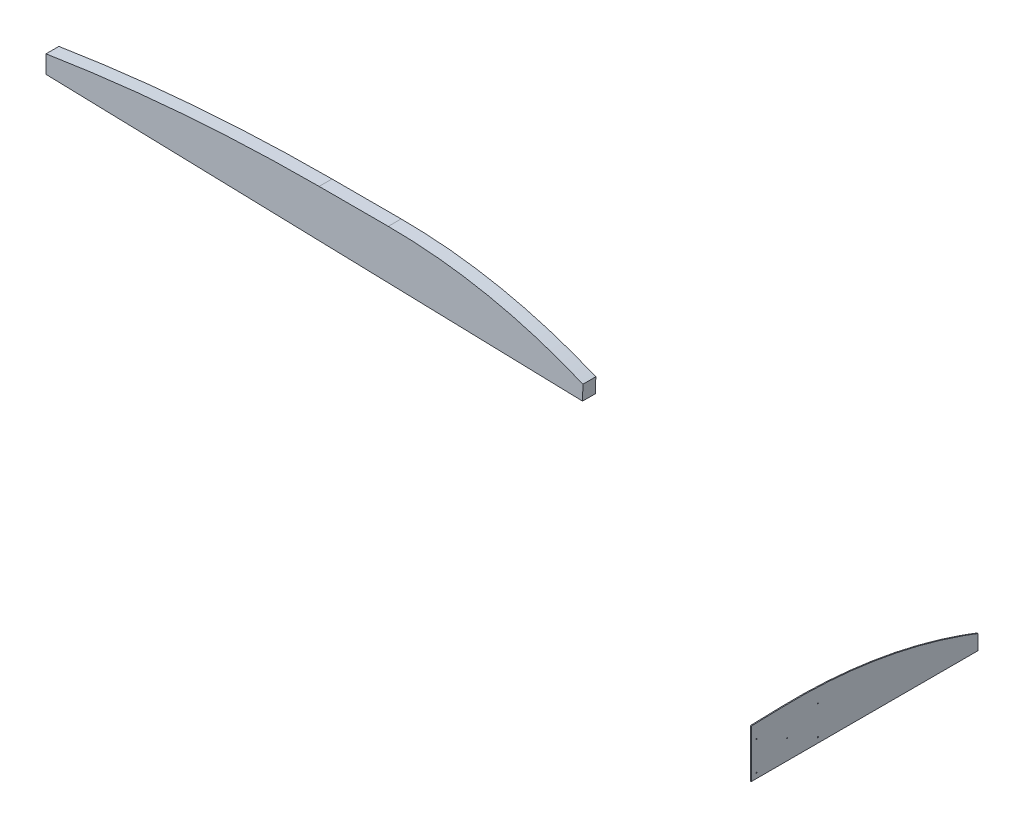
ISO-10303-21;
HEADER;
FILE_DESCRIPTION(('STEP AP214'),'2;1');
FILE_NAME('part.step','',(''),(''),'','','');
FILE_SCHEMA(('AUTOMOTIVE_DESIGN { 1 0 10303 214 1 1 1 1 }'));
ENDSEC;
DATA;
#1=APPLICATION_CONTEXT('core data for automotive mechanical design processes');
#2=APPLICATION_PROTOCOL_DEFINITION('international standard','automotive_design',2000,#1);
#3=PRODUCT_CONTEXT('',#1,'mechanical');
#4=PRODUCT('Part','Part','',(#3));
#5=PRODUCT_RELATED_PRODUCT_CATEGORY('part','',(#4));
#6=PRODUCT_DEFINITION_FORMATION('','',#4);
#7=PRODUCT_DEFINITION_CONTEXT('part definition',#1,'design');
#8=PRODUCT_DEFINITION('design','',#6,#7);
#9=PRODUCT_DEFINITION_SHAPE('','',#8);
#10=(LENGTH_UNIT() NAMED_UNIT(*) SI_UNIT(.MILLI.,.METRE.));
#11=(NAMED_UNIT(*) PLANE_ANGLE_UNIT() SI_UNIT($,.RADIAN.));
#12=(NAMED_UNIT(*) SI_UNIT($,.STERADIAN.) SOLID_ANGLE_UNIT());
#13=UNCERTAINTY_MEASURE_WITH_UNIT(LENGTH_MEASURE(1.E-05),#10,'distance_accuracy_value','');
#14=(GEOMETRIC_REPRESENTATION_CONTEXT(3) GLOBAL_UNCERTAINTY_ASSIGNED_CONTEXT((#13)) GLOBAL_UNIT_ASSIGNED_CONTEXT((#10,
#11,#12)) REPRESENTATION_CONTEXT('',''));
#15=CARTESIAN_POINT('',(0.,0.,0.));
#16=DIRECTION('',(0.,0.,1.));
#17=DIRECTION('',(1.,0.,0.));
#18=AXIS2_PLACEMENT_3D('',#15,#16,#17);
#19=CARTESIAN_POINT('',(9.398,-4451.55209296356,-441.991605716661));
#20=DIRECTION('',(1.,0.,0.));
#21=DIRECTION('',(0.,0.,-1.));
#22=AXIS2_PLACEMENT_3D('',#19,#20,#21);
#23=PLANE('',#22);
#24=CARTESIAN_POINT('',(9.398,337.933597896656,-50.799999999998));
#25=DIRECTION('',(1.,0.,0.));
#26=DIRECTION('',(0.,0.,-1.));
#27=AXIS2_PLACEMENT_3D('',#24,#25,#26);
#28=CIRCLE('',#27,4.76250000000178);
#29=CARTESIAN_POINT('',(9.398,337.933597896656,-55.5624999999997));
#30=VERTEX_POINT('',#29);
#31=EDGE_CURVE('E615',#30,#30,#28,.T.);
#32=ORIENTED_EDGE('',*,*,#31,.F.);
#33=EDGE_LOOP('',(#32));
#34=FACE_BOUND('',#33,.T.);
#35=CARTESIAN_POINT('',(9.398,50.7999999999998,-656.356957586843));
#36=DIRECTION('',(1.,0.,0.));
#37=DIRECTION('',(0.,0.,-1.));
#38=AXIS2_PLACEMENT_3D('',#35,#36,#37);
#39=CIRCLE('',#38,4.76249999999823);
#40=CARTESIAN_POINT('',(9.398,50.7999999999998,-661.119457586842));
#41=VERTEX_POINT('',#40);
#42=EDGE_CURVE('E627',#41,#41,#39,.T.);
#43=ORIENTED_EDGE('',*,*,#42,.F.);
#44=EDGE_LOOP('',(#43));
#45=FACE_BOUND('',#44,.T.);
#46=DIRECTION('',(0.,0.,1.));
#47=VECTOR('',#46,1.);
#48=CARTESIAN_POINT('',(9.398,167.187967798461,-2082.79999886147));
#49=LINE('',#48,#47);
#50=CARTESIAN_POINT('',(9.398,167.187967798461,-2083.05399886147));
#51=VERTEX_POINT('',#50);
#52=CARTESIAN_POINT('',(9.398,167.187967798461,-2082.79999886147));
#53=VERTEX_POINT('',#52);
#54=EDGE_CURVE('E264',#51,#53,#49,.T.);
#55=ORIENTED_EDGE('',*,*,#54,.T.);
#56=DIRECTION('',(0.,1.,0.));
#57=VECTOR('',#56,1.);
#58=CARTESIAN_POINT('',(9.398,203.325679208909,-2082.79999886147));
#59=LINE('',#58,#57);
#60=CARTESIAN_POINT('',(9.398,203.325679208909,-2082.79999886147));
#61=VERTEX_POINT('',#60);
#62=EDGE_CURVE('E267',#53,#61,#59,.T.);
#63=ORIENTED_EDGE('',*,*,#62,.T.);
#64=CARTESIAN_POINT('',(9.398,-4451.55209296356,-441.991605716661));
#65=DIRECTION('',(1.,0.,0.));
#66=DIRECTION('',(0.,0.,-1.));
#67=AXIS2_PLACEMENT_3D('',#64,#65,#66);
#68=CIRCLE('',#67,4935.59917911491);
#69=CARTESIAN_POINT('',(9.398,482.182478790943,-306.336040574028));
#70=VERTEX_POINT('',#69);
#71=EDGE_CURVE('E270',#61,#70,#68,.T.);
#72=ORIENTED_EDGE('',*,*,#71,.T.);
#73=DIRECTION('',(0.,-0.0274851258081607,0.999622212567983));
#74=VECTOR('',#73,1.);
#75=CARTESIAN_POINT('',(9.398,473.759742407122,-0.0047383766571818));
#76=LINE('',#75,#74);
#77=CARTESIAN_POINT('',(9.398,473.759742407122,-0.0047383766571818));
#78=VERTEX_POINT('',#77);
#79=EDGE_CURVE('E272',#70,#78,#76,.T.);
#80=ORIENTED_EDGE('',*,*,#79,.T.);
#81=DIRECTION('',(0.,-1.,0.));
#82=VECTOR('',#81,1.);
#83=CARTESIAN_POINT('',(9.398,473.759742407122,-0.0047383766571818));
#84=LINE('',#83,#82);
#85=CARTESIAN_POINT('',(9.398,-0.00167052485799957,-0.0047383766571818));
#86=VERTEX_POINT('',#85);
#87=EDGE_CURVE('E274',#78,#86,#84,.T.);
#88=ORIENTED_EDGE('',*,*,#87,.T.);
#89=DIRECTION('',(0.,0.,-1.));
#90=VECTOR('',#89,1.);
#91=CARTESIAN_POINT('',(9.398,-0.00167052485799957,-0.0047383766571818));
#92=LINE('',#91,#90);
#93=CARTESIAN_POINT('',(9.398,-0.00167052485799957,-2235.20473837666));
#94=VERTEX_POINT('',#93);
#95=EDGE_CURVE('E276',#86,#94,#92,.T.);
#96=ORIENTED_EDGE('',*,*,#95,.T.);
#97=DIRECTION('',(0.,1.,3.65014932458006E-10));
#98=VECTOR('',#97,1.);
#99=CARTESIAN_POINT('',(9.398,146.765633980461,-2235.20473832308));
#100=LINE('',#99,#98);
#101=CARTESIAN_POINT('',(9.398,146.765633980461,-2235.20473832308));
#102=VERTEX_POINT('',#101);
#103=EDGE_CURVE('E278',#94,#102,#100,.T.);
#104=ORIENTED_EDGE('',*,*,#103,.T.);
#105=CARTESIAN_POINT('',(9.398,-4451.55209296356,-441.991605716661));
#106=DIRECTION('',(1.,0.,0.));
#107=DIRECTION('',(0.,0.,-1.));
#108=AXIS2_PLACEMENT_3D('',#105,#106,#107);
#109=CIRCLE('',#108,4935.59917911491);
#110=CARTESIAN_POINT('',(9.398,203.236138383341,-2083.05399886147));
#111=VERTEX_POINT('',#110);
#112=EDGE_CURVE('E280',#102,#111,#109,.T.);
#113=ORIENTED_EDGE('',*,*,#112,.T.);
#114=DIRECTION('',(0.,-1.,0.));
#115=VECTOR('',#114,1.);
#116=CARTESIAN_POINT('',(9.398,203.236138383341,-2083.05399886147));
#117=LINE('',#116,#115);
#118=EDGE_CURVE('E282',#111,#51,#117,.T.);
#119=ORIENTED_EDGE('',*,*,#118,.T.);
#120=EDGE_LOOP('',(#55,#63,#72,#80,#88,#96,#104,#113,#119));
#121=FACE_BOUND('',#120,.T.);
#122=DIRECTION('',(0.,-1.,0.));
#123=VECTOR('',#122,1.);
#124=CARTESIAN_POINT('',(9.398,176.516033122194,-494.514909267581));
#125=LINE('',#124,#123);
#126=CARTESIAN_POINT('',(9.398,176.516033122194,-494.514909267581));
#127=VERTEX_POINT('',#126);
#128=CARTESIAN_POINT('',(9.398,176.242239609535,-494.514909267581));
#129=VERTEX_POINT('',#128);
#130=EDGE_CURVE('E178',#127,#129,#125,.T.);
#131=ORIENTED_EDGE('',*,*,#130,.T.);
#132=DIRECTION('',(0.,0.,1.));
#133=VECTOR('',#132,1.);
#134=CARTESIAN_POINT('',(9.398,176.242239609535,-494.514909267581));
#135=LINE('',#134,#133);
#136=CARTESIAN_POINT('',(9.398,176.242239609535,-486.022286640998));
#137=VERTEX_POINT('',#136);
#138=EDGE_CURVE('E187',#129,#137,#135,.T.);
#139=ORIENTED_EDGE('',*,*,#138,.T.);
#140=DIRECTION('',(0.,-1.,0.));
#141=VECTOR('',#140,1.);
#142=CARTESIAN_POINT('',(9.398,176.242239609535,-486.022286640998));
#143=LINE('',#142,#141);
#144=CARTESIAN_POINT('',(9.398,170.238877267763,-486.022286640998));
#145=VERTEX_POINT('',#144);
#146=EDGE_CURVE('E60',#137,#145,#143,.T.);
#147=ORIENTED_EDGE('',*,*,#146,.T.);
#148=DIRECTION('',(0.,0.,-1.));
#149=VECTOR('',#148,1.);
#150=CARTESIAN_POINT('',(9.398,170.238877267763,-486.022286640998));
#151=LINE('',#150,#149);
#152=CARTESIAN_POINT('',(9.398,170.238877267763,-490.197009742264));
#153=VERTEX_POINT('',#152);
#154=EDGE_CURVE('E204',#145,#153,#151,.T.);
#155=ORIENTED_EDGE('',*,*,#154,.T.);
#156=DIRECTION('',(0.,-1.,0.));
#157=VECTOR('',#156,1.);
#158=CARTESIAN_POINT('',(9.398,170.238877267763,-490.197009742264));
#159=LINE('',#158,#157);
#160=CARTESIAN_POINT('',(9.398,169.957548153839,-490.197009742264));
#161=VERTEX_POINT('',#160);
#162=EDGE_CURVE('E207',#153,#161,#159,.T.);
#163=ORIENTED_EDGE('',*,*,#162,.T.);
#164=DIRECTION('',(0.,0.,1.));
#165=VECTOR('',#164,1.);
#166=CARTESIAN_POINT('',(9.398,169.957548153839,-490.197009742264));
#167=LINE('',#166,#165);
#168=CARTESIAN_POINT('',(9.398,169.957548153839,-486.022286640998));
#169=VERTEX_POINT('',#168);
#170=EDGE_CURVE('E210',#161,#169,#167,.T.);
#171=ORIENTED_EDGE('',*,*,#170,.T.);
#172=DIRECTION('',(0.,-1.,0.));
#173=VECTOR('',#172,1.);
#174=CARTESIAN_POINT('',(9.398,169.957548153839,-486.022286640998));
#175=LINE('',#174,#173);
#176=CARTESIAN_POINT('',(9.398,163.816033122194,-486.022286640998));
#177=VERTEX_POINT('',#176);
#178=EDGE_CURVE('E213',#169,#177,#175,.T.);
#179=ORIENTED_EDGE('',*,*,#178,.T.);
#180=DIRECTION('',(0.,0.,1.));
#181=VECTOR('',#180,1.);
#182=CARTESIAN_POINT('',(9.398,163.816033122194,-486.022286640998));
#183=LINE('',#182,#181);
#184=CARTESIAN_POINT('',(9.398,163.816033122194,-485.73091005872));
#185=VERTEX_POINT('',#184);
#186=EDGE_CURVE('E216',#177,#185,#183,.T.);
#187=ORIENTED_EDGE('',*,*,#186,.T.);
#188=DIRECTION('',(0.,1.,0.));
#189=VECTOR('',#188,1.);
#190=CARTESIAN_POINT('',(9.398,163.816033122194,-485.73091005872));
#191=LINE('',#190,#189);
#192=CARTESIAN_POINT('',(9.398,176.516033122194,-485.73091005872));
#193=VERTEX_POINT('',#192);
#194=EDGE_CURVE('E219',#185,#193,#191,.T.);
#195=ORIENTED_EDGE('',*,*,#194,.T.);
#196=DIRECTION('',(0.,0.,-1.));
#197=VECTOR('',#196,1.);
#198=CARTESIAN_POINT('',(9.398,176.516033122194,-485.73091005872));
#199=LINE('',#198,#197);
#200=EDGE_CURVE('E184',#193,#127,#199,.T.);
#201=ORIENTED_EDGE('',*,*,#200,.T.);
#202=EDGE_LOOP('',(#131,#139,#147,#155,#163,#171,#179,#187,#195,#201));
#203=FACE_BOUND('',#202,.T.);
#204=CARTESIAN_POINT('',(9.398,337.933597896656,-656.356957586843));
#205=DIRECTION('',(1.,0.,0.));
#206=DIRECTION('',(0.,0.,-1.));
#207=AXIS2_PLACEMENT_3D('',#204,#205,#206);
#208=CIRCLE('',#207,4.76249999999823);
#209=CARTESIAN_POINT('',(9.398,337.933597896656,-661.119457586842));
#210=VERTEX_POINT('',#209);
#211=EDGE_CURVE('E224',#210,#210,#208,.T.);
#212=ORIENTED_EDGE('',*,*,#211,.F.);
#213=EDGE_LOOP('',(#212));
#214=FACE_BOUND('',#213,.T.);
#215=CARTESIAN_POINT('',(9.398,50.7999999999998,-50.799999999998));
#216=DIRECTION('',(1.,0.,0.));
#217=DIRECTION('',(0.,0.,-1.));
#218=AXIS2_PLACEMENT_3D('',#215,#216,#217);
#219=CIRCLE('',#218,4.76250000000178);
#220=CARTESIAN_POINT('',(9.398,50.7999999999998,-55.5624999999997));
#221=VERTEX_POINT('',#220);
#222=EDGE_CURVE('E621',#221,#221,#219,.T.);
#223=ORIENTED_EDGE('',*,*,#222,.F.);
#224=EDGE_LOOP('',(#223));
#225=FACE_BOUND('',#224,.T.);
#226=CARTESIAN_POINT('',(9.398,194.366798948328,-353.578478793422));
#227=DIRECTION('',(1.,0.,0.));
#228=DIRECTION('',(0.,0.,-1.));
#229=AXIS2_PLACEMENT_3D('',#226,#227,#228);
#230=CIRCLE('',#229,4.76249999999823);
#231=CARTESIAN_POINT('',(9.398,194.366798948328,-358.340978793421));
#232=VERTEX_POINT('',#231);
#233=EDGE_CURVE('E606',#232,#232,#230,.T.);
#234=ORIENTED_EDGE('',*,*,#233,.F.);
#235=EDGE_LOOP('',(#234));
#236=FACE_BOUND('',#235,.T.);
#237=ADVANCED_FACE('F45',(#34,#45,#121,#203,#214,#225,#236),#23,.T.);
#238=CARTESIAN_POINT('',(0.,-4451.55209296356,-441.991605716661));
#239=DIRECTION('',(1.,0.,0.));
#240=DIRECTION('',(0.,0.,-1.));
#241=AXIS2_PLACEMENT_3D('',#238,#239,#240);
#242=PLANE('',#241);
#243=DIRECTION('',(0.,0.,1.));
#244=VECTOR('',#243,1.);
#245=CARTESIAN_POINT('',(0.,176.242239609535,-494.514909267581));
#246=LINE('',#245,#244);
#247=CARTESIAN_POINT('',(0.,176.242239609535,-494.514909267581));
#248=VERTEX_POINT('',#247);
#249=CARTESIAN_POINT('',(0.,176.242239609535,-486.022286640998));
#250=VERTEX_POINT('',#249);
#251=EDGE_CURVE('E223',#248,#250,#246,.T.);
#252=ORIENTED_EDGE('',*,*,#251,.F.);
#253=DIRECTION('',(0.,-1.,0.));
#254=VECTOR('',#253,1.);
#255=CARTESIAN_POINT('',(0.,176.516033122194,-494.514909267581));
#256=LINE('',#255,#254);
#257=CARTESIAN_POINT('',(0.,176.516033122194,-494.514909267581));
#258=VERTEX_POINT('',#257);
#259=EDGE_CURVE('E68',#258,#248,#256,.T.);
#260=ORIENTED_EDGE('',*,*,#259,.F.);
#261=DIRECTION('',(0.,0.,-1.));
#262=VECTOR('',#261,1.);
#263=CARTESIAN_POINT('',(0.,176.516033122194,-485.73091005872));
#264=LINE('',#263,#262);
#265=CARTESIAN_POINT('',(0.,176.516033122194,-485.73091005872));
#266=VERTEX_POINT('',#265);
#267=EDGE_CURVE('E194',#266,#258,#264,.T.);
#268=ORIENTED_EDGE('',*,*,#267,.F.);
#269=DIRECTION('',(0.,1.,0.));
#270=VECTOR('',#269,1.);
#271=CARTESIAN_POINT('',(0.,163.816033122194,-485.73091005872));
#272=LINE('',#271,#270);
#273=CARTESIAN_POINT('',(0.,163.816033122194,-485.73091005872));
#274=VERTEX_POINT('',#273);
#275=EDGE_CURVE('E197',#274,#266,#272,.T.);
#276=ORIENTED_EDGE('',*,*,#275,.F.);
#277=DIRECTION('',(0.,0.,1.));
#278=VECTOR('',#277,1.);
#279=CARTESIAN_POINT('',(0.,163.816033122194,-486.022286640998));
#280=LINE('',#279,#278);
#281=CARTESIAN_POINT('',(0.,163.816033122194,-486.022286640998));
#282=VERTEX_POINT('',#281);
#283=EDGE_CURVE('E241',#282,#274,#280,.T.);
#284=ORIENTED_EDGE('',*,*,#283,.F.);
#285=DIRECTION('',(0.,-1.,0.));
#286=VECTOR('',#285,1.);
#287=CARTESIAN_POINT('',(0.,169.957548153839,-486.022286640998));
#288=LINE('',#287,#286);
#289=CARTESIAN_POINT('',(0.,169.957548153839,-486.022286640998));
#290=VERTEX_POINT('',#289);
#291=EDGE_CURVE('E238',#290,#282,#288,.T.);
#292=ORIENTED_EDGE('',*,*,#291,.F.);
#293=DIRECTION('',(0.,0.,1.));
#294=VECTOR('',#293,1.);
#295=CARTESIAN_POINT('',(0.,169.957548153839,-490.197009742264));
#296=LINE('',#295,#294);
#297=CARTESIAN_POINT('',(0.,169.957548153839,-490.197009742264));
#298=VERTEX_POINT('',#297);
#299=EDGE_CURVE('E235',#298,#290,#296,.T.);
#300=ORIENTED_EDGE('',*,*,#299,.F.);
#301=DIRECTION('',(0.,-1.,0.));
#302=VECTOR('',#301,1.);
#303=CARTESIAN_POINT('',(0.,170.238877267763,-490.197009742264));
#304=LINE('',#303,#302);
#305=CARTESIAN_POINT('',(0.,170.238877267763,-490.197009742264));
#306=VERTEX_POINT('',#305);
#307=EDGE_CURVE('E232',#306,#298,#304,.T.);
#308=ORIENTED_EDGE('',*,*,#307,.F.);
#309=DIRECTION('',(0.,0.,-1.));
#310=VECTOR('',#309,1.);
#311=CARTESIAN_POINT('',(0.,170.238877267763,-486.022286640998));
#312=LINE('',#311,#310);
#313=CARTESIAN_POINT('',(0.,170.238877267763,-486.022286640998));
#314=VERTEX_POINT('',#313);
#315=EDGE_CURVE('E229',#314,#306,#312,.T.);
#316=ORIENTED_EDGE('',*,*,#315,.F.);
#317=DIRECTION('',(0.,-1.,0.));
#318=VECTOR('',#317,1.);
#319=CARTESIAN_POINT('',(0.,176.242239609535,-486.022286640998));
#320=LINE('',#319,#318);
#321=EDGE_CURVE('E226',#250,#314,#320,.T.);
#322=ORIENTED_EDGE('',*,*,#321,.F.);
#323=EDGE_LOOP('',(#252,#260,#268,#276,#284,#292,#300,#308,#316,#322));
#324=FACE_BOUND('',#323,.T.);
#325=DIRECTION('',(0.,0.,1.));
#326=VECTOR('',#325,1.);
#327=CARTESIAN_POINT('',(0.,167.187967798461,-2082.79999886147));
#328=LINE('',#327,#326);
#329=CARTESIAN_POINT('',(0.,167.187967798461,-2083.05399886147));
#330=VERTEX_POINT('',#329);
#331=CARTESIAN_POINT('',(0.,167.187967798461,-2082.79999886147));
#332=VERTEX_POINT('',#331);
#333=EDGE_CURVE('E248',#330,#332,#328,.T.);
#334=ORIENTED_EDGE('',*,*,#333,.F.);
#335=DIRECTION('',(0.,-1.,0.));
#336=VECTOR('',#335,1.);
#337=CARTESIAN_POINT('',(0.,203.236138383341,-2083.05399886147));
#338=LINE('',#337,#336);
#339=CARTESIAN_POINT('',(0.,203.236138383341,-2083.05399886147));
#340=VERTEX_POINT('',#339);
#341=EDGE_CURVE('E268',#340,#330,#338,.T.);
#342=ORIENTED_EDGE('',*,*,#341,.F.);
#343=CARTESIAN_POINT('',(0.,-4451.55209296356,-441.991605716661));
#344=DIRECTION('',(1.,0.,0.));
#345=DIRECTION('',(0.,0.,-1.));
#346=AXIS2_PLACEMENT_3D('',#343,#344,#345);
#347=CIRCLE('',#346,4935.59917911491);
#348=CARTESIAN_POINT('',(0.,146.765633980461,-2235.20473832308));
#349=VERTEX_POINT('',#348);
#350=EDGE_CURVE('E299',#349,#340,#347,.T.);
#351=ORIENTED_EDGE('',*,*,#350,.F.);
#352=DIRECTION('',(0.,1.,3.65014932458006E-10));
#353=VECTOR('',#352,1.);
#354=CARTESIAN_POINT('',(0.,146.765633980461,-2235.20473832308));
#355=LINE('',#354,#353);
#356=CARTESIAN_POINT('',(0.,-0.00167052485799957,-2235.20473837666));
#357=VERTEX_POINT('',#356);
#358=EDGE_CURVE('E297',#357,#349,#355,.T.);
#359=ORIENTED_EDGE('',*,*,#358,.F.);
#360=DIRECTION('',(0.,0.,-1.));
#361=VECTOR('',#360,1.);
#362=CARTESIAN_POINT('',(0.,-0.00167052485799957,-0.0047383766571818));
#363=LINE('',#362,#361);
#364=CARTESIAN_POINT('',(0.,-0.00167052485799957,-0.0047383766571818));
#365=VERTEX_POINT('',#364);
#366=EDGE_CURVE('E295',#365,#357,#363,.T.);
#367=ORIENTED_EDGE('',*,*,#366,.F.);
#368=DIRECTION('',(0.,-1.,0.));
#369=VECTOR('',#368,1.);
#370=CARTESIAN_POINT('',(0.,473.759742407122,-0.0047383766571818));
#371=LINE('',#370,#369);
#372=CARTESIAN_POINT('',(0.,473.759742407122,-0.0047383766571818));
#373=VERTEX_POINT('',#372);
#374=EDGE_CURVE('E293',#373,#365,#371,.T.);
#375=ORIENTED_EDGE('',*,*,#374,.F.);
#376=DIRECTION('',(0.,-0.0274851258081607,0.999622212567983));
#377=VECTOR('',#376,1.);
#378=CARTESIAN_POINT('',(0.,473.759742407122,-0.0047383766571818));
#379=LINE('',#378,#377);
#380=CARTESIAN_POINT('',(0.,482.182478790943,-306.336040574028));
#381=VERTEX_POINT('',#380);
#382=EDGE_CURVE('E291',#381,#373,#379,.T.);
#383=ORIENTED_EDGE('',*,*,#382,.F.);
#384=CARTESIAN_POINT('',(0.,-4451.55209296356,-441.991605716661));
#385=DIRECTION('',(1.,0.,0.));
#386=DIRECTION('',(0.,0.,-1.));
#387=AXIS2_PLACEMENT_3D('',#384,#385,#386);
#388=CIRCLE('',#387,4935.59917911491);
#389=CARTESIAN_POINT('',(0.,203.325679208909,-2082.79999886147));
#390=VERTEX_POINT('',#389);
#391=EDGE_CURVE('E289',#390,#381,#388,.T.);
#392=ORIENTED_EDGE('',*,*,#391,.F.);
#393=DIRECTION('',(0.,1.,0.));
#394=VECTOR('',#393,1.);
#395=CARTESIAN_POINT('',(0.,203.325679208909,-2082.79999886147));
#396=LINE('',#395,#394);
#397=EDGE_CURVE('E287',#332,#390,#396,.T.);
#398=ORIENTED_EDGE('',*,*,#397,.F.);
#399=EDGE_LOOP('',(#334,#342,#351,#359,#367,#375,#383,#392,#398));
#400=FACE_BOUND('',#399,.T.);
#401=CARTESIAN_POINT('',(0.,337.933597896656,-656.356957586843));
#402=DIRECTION('',(1.,0.,0.));
#403=DIRECTION('',(0.,0.,-1.));
#404=AXIS2_PLACEMENT_3D('',#401,#402,#403);
#405=CIRCLE('',#404,4.76249999999823);
#406=CARTESIAN_POINT('',(0.,337.933597896656,-661.119457586842));
#407=VERTEX_POINT('',#406);
#408=EDGE_CURVE('E200',#407,#407,#405,.T.);
#409=ORIENTED_EDGE('',*,*,#408,.T.);
#410=EDGE_LOOP('',(#409));
#411=FACE_BOUND('',#410,.T.);
#412=CARTESIAN_POINT('',(0.,50.7999999999998,-656.356957586843));
#413=DIRECTION('',(1.,0.,0.));
#414=DIRECTION('',(0.,0.,-1.));
#415=AXIS2_PLACEMENT_3D('',#412,#413,#414);
#416=CIRCLE('',#415,4.76249999999823);
#417=CARTESIAN_POINT('',(0.,50.7999999999998,-661.119457586842));
#418=VERTEX_POINT('',#417);
#419=EDGE_CURVE('E624',#418,#418,#416,.T.);
#420=ORIENTED_EDGE('',*,*,#419,.T.);
#421=EDGE_LOOP('',(#420));
#422=FACE_BOUND('',#421,.T.);
#423=CARTESIAN_POINT('',(0.,50.7999999999998,-50.799999999998));
#424=DIRECTION('',(1.,0.,0.));
#425=DIRECTION('',(0.,0.,-1.));
#426=AXIS2_PLACEMENT_3D('',#423,#424,#425);
#427=CIRCLE('',#426,4.76250000000178);
#428=CARTESIAN_POINT('',(0.,50.7999999999998,-55.5624999999997));
#429=VERTEX_POINT('',#428);
#430=EDGE_CURVE('E618',#429,#429,#427,.T.);
#431=ORIENTED_EDGE('',*,*,#430,.T.);
#432=EDGE_LOOP('',(#431));
#433=FACE_BOUND('',#432,.T.);
#434=CARTESIAN_POINT('',(0.,337.933597896656,-50.799999999998));
#435=DIRECTION('',(1.,0.,0.));
#436=DIRECTION('',(0.,0.,-1.));
#437=AXIS2_PLACEMENT_3D('',#434,#435,#436);
#438=CIRCLE('',#437,4.76250000000178);
#439=CARTESIAN_POINT('',(0.,337.933597896656,-55.5624999999997));
#440=VERTEX_POINT('',#439);
#441=EDGE_CURVE('E612',#440,#440,#438,.T.);
#442=ORIENTED_EDGE('',*,*,#441,.T.);
#443=EDGE_LOOP('',(#442));
#444=FACE_BOUND('',#443,.T.);
#445=CARTESIAN_POINT('',(0.,194.366798948328,-353.578478793422));
#446=DIRECTION('',(1.,0.,0.));
#447=DIRECTION('',(0.,0.,-1.));
#448=AXIS2_PLACEMENT_3D('',#445,#446,#447);
#449=CIRCLE('',#448,4.76249999999823);
#450=CARTESIAN_POINT('',(0.,194.366798948328,-358.340978793421));
#451=VERTEX_POINT('',#450);
#452=EDGE_CURVE('E609',#451,#451,#449,.T.);
#453=ORIENTED_EDGE('',*,*,#452,.T.);
#454=EDGE_LOOP('',(#453));
#455=FACE_BOUND('',#454,.T.);
#456=ADVANCED_FACE('F332',(#324,#400,#411,#422,#433,#444,#455),#242,.F.);
#457=CARTESIAN_POINT('',(9.398,167.187967798461,-2082.79999886147));
#458=DIRECTION('',(0.,-1.,0.));
#459=DIRECTION('',(0.,0.,-1.));
#460=AXIS2_PLACEMENT_3D('',#457,#458,#459);
#461=PLANE('',#460);
#462=ORIENTED_EDGE('',*,*,#333,.T.);
#463=DIRECTION('',(-1.,0.,0.));
#464=VECTOR('',#463,1.);
#465=CARTESIAN_POINT('',(9.398,167.187967798461,-2082.79999886147));
#466=LINE('',#465,#464);
#467=EDGE_CURVE('E12',#53,#332,#466,.T.);
#468=ORIENTED_EDGE('',*,*,#467,.F.);
#469=ORIENTED_EDGE('',*,*,#54,.F.);
#470=DIRECTION('',(-1.,0.,0.));
#471=VECTOR('',#470,1.);
#472=CARTESIAN_POINT('',(9.398,167.187967798461,-2083.05399886147));
#473=LINE('',#472,#471);
#474=EDGE_CURVE('E284',#51,#330,#473,.T.);
#475=ORIENTED_EDGE('',*,*,#474,.T.);
#476=EDGE_LOOP('',(#462,#468,#469,#475));
#477=FACE_BOUND('',#476,.T.);
#478=ADVANCED_FACE('F47',(#477),#461,.F.);
#479=CARTESIAN_POINT('',(9.398,203.325679208909,-2082.79999886147));
#480=DIRECTION('',(0.,0.,1.));
#481=DIRECTION('',(1.,0.,0.));
#482=AXIS2_PLACEMENT_3D('',#479,#480,#481);
#483=PLANE('',#482);
#484=ORIENTED_EDGE('',*,*,#397,.T.);
#485=DIRECTION('',(-1.,0.,0.));
#486=VECTOR('',#485,1.);
#487=CARTESIAN_POINT('',(9.398,203.325679208909,-2082.79999886147));
#488=LINE('',#487,#486);
#489=EDGE_CURVE('E53',#61,#390,#488,.T.);
#490=ORIENTED_EDGE('',*,*,#489,.F.);
#491=ORIENTED_EDGE('',*,*,#62,.F.);
#492=ORIENTED_EDGE('',*,*,#467,.T.);
#493=EDGE_LOOP('',(#484,#490,#491,#492));
#494=FACE_BOUND('',#493,.T.);
#495=ADVANCED_FACE('F349',(#494),#483,.F.);
#496=CARTESIAN_POINT('',(9.398,-4451.55209296356,-441.991605716661));
#497=DIRECTION('',(-1.,0.,0.));
#498=DIRECTION('',(0.,0.,1.));
#499=AXIS2_PLACEMENT_3D('',#496,#497,#498);
#500=CYLINDRICAL_SURFACE('',#499,4935.59917911491);
#501=ORIENTED_EDGE('',*,*,#391,.T.);
#502=DIRECTION('',(-1.,0.,0.));
#503=VECTOR('',#502,1.);
#504=CARTESIAN_POINT('',(9.398,482.182478790943,-306.336040574028));
#505=LINE('',#504,#503);
#506=EDGE_CURVE('E319',#70,#381,#505,.T.);
#507=ORIENTED_EDGE('',*,*,#506,.F.);
#508=ORIENTED_EDGE('',*,*,#71,.F.);
#509=ORIENTED_EDGE('',*,*,#489,.T.);
#510=EDGE_LOOP('',(#501,#507,#508,#509));
#511=FACE_BOUND('',#510,.T.);
#512=ADVANCED_FACE('F326',(#511),#500,.T.);
#513=CARTESIAN_POINT('',(9.398,473.759742407122,-0.0047383766571818));
#514=DIRECTION('',(0.,-0.999622212567983,-0.0274851258081607));
#515=DIRECTION('',(0.,0.0274851258081607,-0.999622212567983));
#516=AXIS2_PLACEMENT_3D('',#513,#514,#515);
#517=PLANE('',#516);
#518=ORIENTED_EDGE('',*,*,#382,.T.);
#519=DIRECTION('',(-1.,0.,0.));
#520=VECTOR('',#519,1.);
#521=CARTESIAN_POINT('',(9.398,473.759742407122,-0.0047383766571818));
#522=LINE('',#521,#520);
#523=EDGE_CURVE('E316',#78,#373,#522,.T.);
#524=ORIENTED_EDGE('',*,*,#523,.F.);
#525=ORIENTED_EDGE('',*,*,#79,.F.);
#526=ORIENTED_EDGE('',*,*,#506,.T.);
#527=EDGE_LOOP('',(#518,#524,#525,#526));
#528=FACE_BOUND('',#527,.T.);
#529=ADVANCED_FACE('F338',(#528),#517,.F.);
#530=CARTESIAN_POINT('',(9.398,473.759742407122,-0.0047383766571818));
#531=DIRECTION('',(0.,0.,-1.));
#532=DIRECTION('',(-1.,0.,0.));
#533=AXIS2_PLACEMENT_3D('',#530,#531,#532);
#534=PLANE('',#533);
#535=ORIENTED_EDGE('',*,*,#374,.T.);
#536=DIRECTION('',(-1.,0.,0.));
#537=VECTOR('',#536,1.);
#538=CARTESIAN_POINT('',(9.398,-0.00167052485799957,-0.0047383766571818));
#539=LINE('',#538,#537);
#540=EDGE_CURVE('E313',#86,#365,#539,.T.);
#541=ORIENTED_EDGE('',*,*,#540,.F.);
#542=ORIENTED_EDGE('',*,*,#87,.F.);
#543=ORIENTED_EDGE('',*,*,#523,.T.);
#544=EDGE_LOOP('',(#535,#541,#542,#543));
#545=FACE_BOUND('',#544,.T.);
#546=ADVANCED_FACE('F342',(#545),#534,.F.);
#547=CARTESIAN_POINT('',(9.398,-0.00167052485799957,-0.0047383766571818));
#548=DIRECTION('',(0.,1.,0.));
#549=DIRECTION('',(0.,0.,1.));
#550=AXIS2_PLACEMENT_3D('',#547,#548,#549);
#551=PLANE('',#550);
#552=ORIENTED_EDGE('',*,*,#366,.T.);
#553=DIRECTION('',(-1.,0.,0.));
#554=VECTOR('',#553,1.);
#555=CARTESIAN_POINT('',(9.398,-0.00167052485799957,-2235.20473837666));
#556=LINE('',#555,#554);
#557=EDGE_CURVE('E310',#94,#357,#556,.T.);
#558=ORIENTED_EDGE('',*,*,#557,.F.);
#559=ORIENTED_EDGE('',*,*,#95,.F.);
#560=ORIENTED_EDGE('',*,*,#540,.T.);
#561=EDGE_LOOP('',(#552,#558,#559,#560));
#562=FACE_BOUND('',#561,.T.);
#563=ADVANCED_FACE('F367',(#562),#551,.F.);
#564=CARTESIAN_POINT('',(9.398,146.765633980461,-2235.20473832308));
#565=DIRECTION('',(0.,-3.65014932458006E-10,1.));
#566=DIRECTION('',(0.,-1.,-3.65014932458006E-10));
#567=AXIS2_PLACEMENT_3D('',#564,#565,#566);
#568=PLANE('',#567);
#569=ORIENTED_EDGE('',*,*,#358,.T.);
#570=DIRECTION('',(-1.,0.,0.));
#571=VECTOR('',#570,1.);
#572=CARTESIAN_POINT('',(9.398,146.765633980461,-2235.20473832308));
#573=LINE('',#572,#571);
#574=EDGE_CURVE('E307',#102,#349,#573,.T.);
#575=ORIENTED_EDGE('',*,*,#574,.F.);
#576=ORIENTED_EDGE('',*,*,#103,.F.);
#577=ORIENTED_EDGE('',*,*,#557,.T.);
#578=EDGE_LOOP('',(#569,#575,#576,#577));
#579=FACE_BOUND('',#578,.T.);
#580=ADVANCED_FACE('F365',(#579),#568,.F.);
#581=CARTESIAN_POINT('',(9.398,-4451.55209296356,-441.991605716661));
#582=DIRECTION('',(-1.,0.,0.));
#583=DIRECTION('',(0.,0.,1.));
#584=AXIS2_PLACEMENT_3D('',#581,#582,#583);
#585=CYLINDRICAL_SURFACE('',#584,4935.59917911491);
#586=ORIENTED_EDGE('',*,*,#350,.T.);
#587=DIRECTION('',(-1.,0.,0.));
#588=VECTOR('',#587,1.);
#589=CARTESIAN_POINT('',(9.398,203.236138383341,-2083.05399886147));
#590=LINE('',#589,#588);
#591=EDGE_CURVE('E304',#111,#340,#590,.T.);
#592=ORIENTED_EDGE('',*,*,#591,.F.);
#593=ORIENTED_EDGE('',*,*,#112,.F.);
#594=ORIENTED_EDGE('',*,*,#574,.T.);
#595=EDGE_LOOP('',(#586,#592,#593,#594));
#596=FACE_BOUND('',#595,.T.);
#597=ADVANCED_FACE('F361',(#596),#585,.T.);
#598=CARTESIAN_POINT('',(9.398,203.236138383341,-2083.05399886147));
#599=DIRECTION('',(0.,0.,-1.));
#600=DIRECTION('',(-1.,0.,0.));
#601=AXIS2_PLACEMENT_3D('',#598,#599,#600);
#602=PLANE('',#601);
#603=ORIENTED_EDGE('',*,*,#341,.T.);
#604=ORIENTED_EDGE('',*,*,#474,.F.);
#605=ORIENTED_EDGE('',*,*,#118,.F.);
#606=ORIENTED_EDGE('',*,*,#591,.T.);
#607=EDGE_LOOP('',(#603,#604,#605,#606));
#608=FACE_BOUND('',#607,.T.);
#609=ADVANCED_FACE('F356',(#608),#602,.F.);
#610=CARTESIAN_POINT('',(9.398,176.516033122194,-494.514909267581));
#611=DIRECTION('',(0.,0.,-1.));
#612=DIRECTION('',(-1.,0.,0.));
#613=AXIS2_PLACEMENT_3D('',#610,#611,#612);
#614=PLANE('',#613);
#615=ORIENTED_EDGE('',*,*,#259,.T.);
#616=DIRECTION('',(-1.,0.,0.));
#617=VECTOR('',#616,1.);
#618=CARTESIAN_POINT('',(9.398,176.242239609535,-494.514909267581));
#619=LINE('',#618,#617);
#620=EDGE_CURVE('E174',#129,#248,#619,.T.);
#621=ORIENTED_EDGE('',*,*,#620,.F.);
#622=ORIENTED_EDGE('',*,*,#130,.F.);
#623=DIRECTION('',(-1.,0.,0.));
#624=VECTOR('',#623,1.);
#625=CARTESIAN_POINT('',(9.398,176.516033122194,-494.514909267581));
#626=LINE('',#625,#624);
#627=EDGE_CURVE('E246',#127,#258,#626,.T.);
#628=ORIENTED_EDGE('',*,*,#627,.T.);
#629=EDGE_LOOP('',(#615,#621,#622,#628));
#630=FACE_BOUND('',#629,.T.);
#631=ADVANCED_FACE('F176',(#630),#614,.F.);
#632=CARTESIAN_POINT('',(9.398,176.516033122194,-485.73091005872));
#633=DIRECTION('',(0.,1.,0.));
#634=DIRECTION('',(0.,0.,1.));
#635=AXIS2_PLACEMENT_3D('',#632,#633,#634);
#636=PLANE('',#635);
#637=ORIENTED_EDGE('',*,*,#267,.T.);
#638=ORIENTED_EDGE('',*,*,#627,.F.);
#639=ORIENTED_EDGE('',*,*,#200,.F.);
#640=DIRECTION('',(-1.,0.,0.));
#641=VECTOR('',#640,1.);
#642=CARTESIAN_POINT('',(9.398,176.516033122194,-485.73091005872));
#643=LINE('',#642,#641);
#644=EDGE_CURVE('E249',#193,#266,#643,.T.);
#645=ORIENTED_EDGE('',*,*,#644,.T.);
#646=EDGE_LOOP('',(#637,#638,#639,#645));
#647=FACE_BOUND('',#646,.T.);
#648=ADVANCED_FACE('F406',(#647),#636,.F.);
#649=CARTESIAN_POINT('',(9.398,163.816033122194,-485.73091005872));
#650=DIRECTION('',(0.,0.,1.));
#651=DIRECTION('',(1.,0.,0.));
#652=AXIS2_PLACEMENT_3D('',#649,#650,#651);
#653=PLANE('',#652);
#654=ORIENTED_EDGE('',*,*,#275,.T.);
#655=ORIENTED_EDGE('',*,*,#644,.F.);
#656=ORIENTED_EDGE('',*,*,#194,.F.);
#657=DIRECTION('',(-1.,0.,0.));
#658=VECTOR('',#657,1.);
#659=CARTESIAN_POINT('',(9.398,163.816033122194,-485.73091005872));
#660=LINE('',#659,#658);
#661=EDGE_CURVE('E251',#185,#274,#660,.T.);
#662=ORIENTED_EDGE('',*,*,#661,.T.);
#663=EDGE_LOOP('',(#654,#655,#656,#662));
#664=FACE_BOUND('',#663,.T.);
#665=ADVANCED_FACE('F412',(#664),#653,.F.);
#666=CARTESIAN_POINT('',(9.398,163.816033122194,-486.022286640998));
#667=DIRECTION('',(0.,-1.,0.));
#668=DIRECTION('',(0.,0.,-1.));
#669=AXIS2_PLACEMENT_3D('',#666,#667,#668);
#670=PLANE('',#669);
#671=ORIENTED_EDGE('',*,*,#283,.T.);
#672=ORIENTED_EDGE('',*,*,#661,.F.);
#673=ORIENTED_EDGE('',*,*,#186,.F.);
#674=DIRECTION('',(-1.,0.,0.));
#675=VECTOR('',#674,1.);
#676=CARTESIAN_POINT('',(9.398,163.816033122194,-486.022286640998));
#677=LINE('',#676,#675);
#678=EDGE_CURVE('E253',#177,#282,#677,.T.);
#679=ORIENTED_EDGE('',*,*,#678,.T.);
#680=EDGE_LOOP('',(#671,#672,#673,#679));
#681=FACE_BOUND('',#680,.T.);
#682=ADVANCED_FACE('F420',(#681),#670,.F.);
#683=CARTESIAN_POINT('',(9.398,169.957548153839,-486.022286640998));
#684=DIRECTION('',(0.,0.,-1.));
#685=DIRECTION('',(-1.,0.,0.));
#686=AXIS2_PLACEMENT_3D('',#683,#684,#685);
#687=PLANE('',#686);
#688=ORIENTED_EDGE('',*,*,#291,.T.);
#689=ORIENTED_EDGE('',*,*,#678,.F.);
#690=ORIENTED_EDGE('',*,*,#178,.F.);
#691=DIRECTION('',(-1.,0.,0.));
#692=VECTOR('',#691,1.);
#693=CARTESIAN_POINT('',(9.398,169.957548153839,-486.022286640998));
#694=LINE('',#693,#692);
#695=EDGE_CURVE('E255',#169,#290,#694,.T.);
#696=ORIENTED_EDGE('',*,*,#695,.T.);
#697=EDGE_LOOP('',(#688,#689,#690,#696));
#698=FACE_BOUND('',#697,.T.);
#699=ADVANCED_FACE('F428',(#698),#687,.F.);
#700=CARTESIAN_POINT('',(9.398,169.957548153839,-490.197009742264));
#701=DIRECTION('',(0.,-1.,0.));
#702=DIRECTION('',(0.,0.,-1.));
#703=AXIS2_PLACEMENT_3D('',#700,#701,#702);
#704=PLANE('',#703);
#705=ORIENTED_EDGE('',*,*,#299,.T.);
#706=ORIENTED_EDGE('',*,*,#695,.F.);
#707=ORIENTED_EDGE('',*,*,#170,.F.);
#708=DIRECTION('',(-1.,0.,0.));
#709=VECTOR('',#708,1.);
#710=CARTESIAN_POINT('',(9.398,169.957548153839,-490.197009742264));
#711=LINE('',#710,#709);
#712=EDGE_CURVE('E257',#161,#298,#711,.T.);
#713=ORIENTED_EDGE('',*,*,#712,.T.);
#714=EDGE_LOOP('',(#705,#706,#707,#713));
#715=FACE_BOUND('',#714,.T.);
#716=ADVANCED_FACE('F436',(#715),#704,.F.);
#717=CARTESIAN_POINT('',(9.398,170.238877267763,-490.197009742264));
#718=DIRECTION('',(0.,0.,-1.));
#719=DIRECTION('',(-1.,0.,0.));
#720=AXIS2_PLACEMENT_3D('',#717,#718,#719);
#721=PLANE('',#720);
#722=ORIENTED_EDGE('',*,*,#307,.T.);
#723=ORIENTED_EDGE('',*,*,#712,.F.);
#724=ORIENTED_EDGE('',*,*,#162,.F.);
#725=DIRECTION('',(-1.,0.,0.));
#726=VECTOR('',#725,1.);
#727=CARTESIAN_POINT('',(9.398,170.238877267763,-490.197009742264));
#728=LINE('',#727,#726);
#729=EDGE_CURVE('E259',#153,#306,#728,.T.);
#730=ORIENTED_EDGE('',*,*,#729,.T.);
#731=EDGE_LOOP('',(#722,#723,#724,#730));
#732=FACE_BOUND('',#731,.T.);
#733=ADVANCED_FACE('F444',(#732),#721,.F.);
#734=CARTESIAN_POINT('',(9.398,170.238877267763,-486.022286640998));
#735=DIRECTION('',(0.,1.,0.));
#736=DIRECTION('',(0.,0.,1.));
#737=AXIS2_PLACEMENT_3D('',#734,#735,#736);
#738=PLANE('',#737);
#739=ORIENTED_EDGE('',*,*,#315,.T.);
#740=ORIENTED_EDGE('',*,*,#729,.F.);
#741=ORIENTED_EDGE('',*,*,#154,.F.);
#742=DIRECTION('',(-1.,0.,0.));
#743=VECTOR('',#742,1.);
#744=CARTESIAN_POINT('',(9.398,170.238877267763,-486.022286640998));
#745=LINE('',#744,#743);
#746=EDGE_CURVE('E261',#145,#314,#745,.T.);
#747=ORIENTED_EDGE('',*,*,#746,.T.);
#748=EDGE_LOOP('',(#739,#740,#741,#747));
#749=FACE_BOUND('',#748,.T.);
#750=ADVANCED_FACE('F452',(#749),#738,.F.);
#751=CARTESIAN_POINT('',(9.398,176.242239609535,-486.022286640998));
#752=DIRECTION('',(0.,0.,-1.));
#753=DIRECTION('',(-1.,0.,0.));
#754=AXIS2_PLACEMENT_3D('',#751,#752,#753);
#755=PLANE('',#754);
#756=ORIENTED_EDGE('',*,*,#321,.T.);
#757=ORIENTED_EDGE('',*,*,#746,.F.);
#758=ORIENTED_EDGE('',*,*,#146,.F.);
#759=DIRECTION('',(-1.,0.,0.));
#760=VECTOR('',#759,1.);
#761=CARTESIAN_POINT('',(9.398,176.242239609535,-486.022286640998));
#762=LINE('',#761,#760);
#763=EDGE_CURVE('E183',#137,#250,#762,.T.);
#764=ORIENTED_EDGE('',*,*,#763,.T.);
#765=EDGE_LOOP('',(#756,#757,#758,#764));
#766=FACE_BOUND('',#765,.T.);
#767=ADVANCED_FACE('F460',(#766),#755,.F.);
#768=CARTESIAN_POINT('',(9.398,176.242239609535,-494.514909267581));
#769=DIRECTION('',(0.,-1.,0.));
#770=DIRECTION('',(0.,0.,-1.));
#771=AXIS2_PLACEMENT_3D('',#768,#769,#770);
#772=PLANE('',#771);
#773=ORIENTED_EDGE('',*,*,#251,.T.);
#774=ORIENTED_EDGE('',*,*,#763,.F.);
#775=ORIENTED_EDGE('',*,*,#138,.F.);
#776=ORIENTED_EDGE('',*,*,#620,.T.);
#777=EDGE_LOOP('',(#773,#774,#775,#776));
#778=FACE_BOUND('',#777,.T.);
#779=ADVANCED_FACE('F188',(#778),#772,.F.);
#780=CARTESIAN_POINT('',(9.398,337.933597896656,-656.356957586843));
#781=DIRECTION('',(-1.,0.,0.));
#782=DIRECTION('',(0.,0.,1.));
#783=AXIS2_PLACEMENT_3D('',#780,#781,#782);
#784=CYLINDRICAL_SURFACE('',#783,4.76249999999823);
#785=ORIENTED_EDGE('',*,*,#211,.T.);
#786=EDGE_LOOP('',(#785));
#787=FACE_BOUND('',#786,.T.);
#788=ORIENTED_EDGE('',*,*,#408,.F.);
#789=EDGE_LOOP('',(#788));
#790=FACE_BOUND('',#789,.T.);
#791=ADVANCED_FACE('F474',(#787,#790),#784,.F.);
#792=CARTESIAN_POINT('',(9.398,50.7999999999998,-656.356957586843));
#793=DIRECTION('',(-1.,0.,0.));
#794=DIRECTION('',(0.,0.,1.));
#795=AXIS2_PLACEMENT_3D('',#792,#793,#794);
#796=CYLINDRICAL_SURFACE('',#795,4.76249999999823);
#797=ORIENTED_EDGE('',*,*,#42,.T.);
#798=EDGE_LOOP('',(#797));
#799=FACE_BOUND('',#798,.T.);
#800=ORIENTED_EDGE('',*,*,#419,.F.);
#801=EDGE_LOOP('',(#800));
#802=FACE_BOUND('',#801,.T.);
#803=ADVANCED_FACE('F480',(#799,#802),#796,.F.);
#804=CARTESIAN_POINT('',(9.398,50.7999999999998,-50.799999999998));
#805=DIRECTION('',(-1.,0.,0.));
#806=DIRECTION('',(0.,0.,1.));
#807=AXIS2_PLACEMENT_3D('',#804,#805,#806);
#808=CYLINDRICAL_SURFACE('',#807,4.76250000000178);
#809=ORIENTED_EDGE('',*,*,#222,.T.);
#810=EDGE_LOOP('',(#809));
#811=FACE_BOUND('',#810,.T.);
#812=ORIENTED_EDGE('',*,*,#430,.F.);
#813=EDGE_LOOP('',(#812));
#814=FACE_BOUND('',#813,.T.);
#815=ADVANCED_FACE('F488',(#811,#814),#808,.F.);
#816=CARTESIAN_POINT('',(9.398,337.933597896656,-50.799999999998));
#817=DIRECTION('',(-1.,0.,0.));
#818=DIRECTION('',(0.,0.,1.));
#819=AXIS2_PLACEMENT_3D('',#816,#817,#818);
#820=CYLINDRICAL_SURFACE('',#819,4.76250000000178);
#821=ORIENTED_EDGE('',*,*,#31,.T.);
#822=EDGE_LOOP('',(#821));
#823=FACE_BOUND('',#822,.T.);
#824=ORIENTED_EDGE('',*,*,#441,.F.);
#825=EDGE_LOOP('',(#824));
#826=FACE_BOUND('',#825,.T.);
#827=ADVANCED_FACE('F496',(#823,#826),#820,.F.);
#828=CARTESIAN_POINT('',(9.398,194.366798948328,-353.578478793422));
#829=DIRECTION('',(-1.,0.,0.));
#830=DIRECTION('',(0.,0.,1.));
#831=AXIS2_PLACEMENT_3D('',#828,#829,#830);
#832=CYLINDRICAL_SURFACE('',#831,4.76249999999823);
#833=ORIENTED_EDGE('',*,*,#233,.T.);
#834=EDGE_LOOP('',(#833));
#835=FACE_BOUND('',#834,.T.);
#836=ORIENTED_EDGE('',*,*,#452,.F.);
#837=EDGE_LOOP('',(#836));
#838=FACE_BOUND('',#837,.T.);
#839=ADVANCED_FACE('F504',(#835,#838),#832,.F.);
#840=CLOSED_SHELL('',(#237,#456,#478,#495,#512,#529,#546,#563,#580,#597,#609,#631,#648,#665,
#682,#699,#716,#733,#750,#767,#779,#791,#803,#815,#827,#839));
#841=MANIFOLD_SOLID_BREP('B2',#840);
#842=CARTESIAN_POINT('',(-4.00917848204745E-12,3078.50276938672,127.));
#843=DIRECTION('',(0.,1.,0.));
#844=DIRECTION('',(-1.,0.,0.));
#845=AXIS2_PLACEMENT_3D('',#842,#843,#844);
#846=PLANE('',#845);
#847=DIRECTION('',(1.,0.,0.));
#848=VECTOR('',#847,1.);
#849=CARTESIAN_POINT('',(-4.00917848204745E-12,3078.50276938672,0.));
#850=LINE('',#849,#848);
#851=CARTESIAN_POINT('',(-4124.10138473646,3078.50276938672,0.));
#852=VERTEX_POINT('',#851);
#853=CARTESIAN_POINT('',(-3442.10138473647,3078.50276938672,0.));
#854=VERTEX_POINT('',#853);
#855=EDGE_CURVE('E748',#852,#854,#850,.T.);
#856=ORIENTED_EDGE('',*,*,#855,.F.);
#857=DIRECTION('',(0.,0.,-1.));
#858=VECTOR('',#857,1.);
#859=CARTESIAN_POINT('',(-4124.10138473646,3078.50276938672,127.));
#860=LINE('',#859,#858);
#861=CARTESIAN_POINT('',(-4124.10138473646,3078.50276938672,127.));
#862=VERTEX_POINT('',#861);
#863=EDGE_CURVE('E43',#862,#852,#860,.T.);
#864=ORIENTED_EDGE('',*,*,#863,.F.);
#865=DIRECTION('',(1.,0.,0.));
#866=VECTOR('',#865,1.);
#867=CARTESIAN_POINT('',(-4.00917848204745E-12,3078.50276938672,127.));
#868=LINE('',#867,#866);
#869=CARTESIAN_POINT('',(-3442.10138473647,3078.50276938672,127.));
#870=VERTEX_POINT('',#869);
#871=EDGE_CURVE('E760',#862,#870,#868,.T.);
#872=ORIENTED_EDGE('',*,*,#871,.T.);
#873=DIRECTION('',(0.,0.,-1.));
#874=VECTOR('',#873,1.);
#875=CARTESIAN_POINT('',(-3442.10138473647,3078.50276938672,127.));
#876=LINE('',#875,#874);
#877=EDGE_CURVE('E710',#870,#854,#876,.T.);
#878=ORIENTED_EDGE('',*,*,#877,.T.);
#879=EDGE_LOOP('',(#856,#864,#872,#878));
#880=FACE_BOUND('',#879,.T.);
#881=ADVANCED_FACE('F666',(#880),#846,.T.);
#882=CARTESIAN_POINT('',(-4124.10138473647,-13950.1652306133,127.));
#883=DIRECTION('',(0.,0.,-1.));
#884=DIRECTION('',(-1.,0.,0.));
#885=AXIS2_PLACEMENT_3D('',#882,#883,#884);
#886=CYLINDRICAL_SURFACE('',#885,17028.668);
#887=CARTESIAN_POINT('',(-4124.10138473647,-13950.1652306133,0.));
#888=DIRECTION('',(0.,0.,1.));
#889=DIRECTION('',(1.,0.,0.));
#890=AXIS2_PLACEMENT_3D('',#887,#888,#889);
#891=CIRCLE('',#890,17028.668);
#892=CARTESIAN_POINT('',(-6816.50138473646,2864.30818053534,0.));
#893=VERTEX_POINT('',#892);
#894=EDGE_CURVE('E751',#852,#893,#891,.T.);
#895=ORIENTED_EDGE('',*,*,#894,.T.);
#896=DIRECTION('',(0.,0.,-1.));
#897=VECTOR('',#896,1.);
#898=CARTESIAN_POINT('',(-6816.50138473646,2864.30818053534,127.));
#899=LINE('',#898,#897);
#900=CARTESIAN_POINT('',(-6816.50138473646,2864.30818053534,127.));
#901=VERTEX_POINT('',#900);
#902=EDGE_CURVE('E674',#901,#893,#899,.T.);
#903=ORIENTED_EDGE('',*,*,#902,.F.);
#904=CARTESIAN_POINT('',(-4124.10138473647,-13950.1652306133,127.));
#905=DIRECTION('',(0.,0.,1.));
#906=DIRECTION('',(1.,0.,0.));
#907=AXIS2_PLACEMENT_3D('',#904,#905,#906);
#908=CIRCLE('',#907,17028.668);
#909=EDGE_CURVE('E773',#862,#901,#908,.T.);
#910=ORIENTED_EDGE('',*,*,#909,.F.);
#911=ORIENTED_EDGE('',*,*,#863,.T.);
#912=EDGE_LOOP('',(#895,#903,#910,#911));
#913=FACE_BOUND('',#912,.T.);
#914=ADVANCED_FACE('F776',(#913),#886,.T.);
#915=CARTESIAN_POINT('',(-6816.50138473645,-3.37132605590967E-11,127.));
#916=DIRECTION('',(1.,0.,0.));
#917=DIRECTION('',(0.,1.,0.));
#918=AXIS2_PLACEMENT_3D('',#915,#916,#917);
#919=PLANE('',#918);
#920=DIRECTION('',(0.,-1.,0.));
#921=VECTOR('',#920,1.);
#922=CARTESIAN_POINT('',(-6816.50138473645,-3.37132605590967E-11,0.));
#923=LINE('',#922,#921);
#924=CARTESIAN_POINT('',(-6816.50138473646,2688.91724758335,0.));
#925=VERTEX_POINT('',#924);
#926=EDGE_CURVE('E753',#893,#925,#923,.T.);
#927=ORIENTED_EDGE('',*,*,#926,.T.);
#928=DIRECTION('',(0.,0.,-1.));
#929=VECTOR('',#928,1.);
#930=CARTESIAN_POINT('',(-6816.50138473646,2688.91724758335,127.));
#931=LINE('',#930,#929);
#932=CARTESIAN_POINT('',(-6816.50138473646,2688.91724758335,127.));
#933=VERTEX_POINT('',#932);
#934=EDGE_CURVE('E741',#933,#925,#931,.T.);
#935=ORIENTED_EDGE('',*,*,#934,.F.);
#936=DIRECTION('',(0.,-1.,0.));
#937=VECTOR('',#936,1.);
#938=CARTESIAN_POINT('',(-6816.50138473645,-3.37132605590967E-11,127.));
#939=LINE('',#938,#937);
#940=EDGE_CURVE('E728',#901,#933,#939,.T.);
#941=ORIENTED_EDGE('',*,*,#940,.F.);
#942=ORIENTED_EDGE('',*,*,#902,.T.);
#943=EDGE_LOOP('',(#927,#935,#941,#942));
#944=FACE_BOUND('',#943,.T.);
#945=ADVANCED_FACE('F767',(#944),#919,.F.);
#946=CARTESIAN_POINT('',(68.7278964317983,2499.60435751643,127.));
#947=DIRECTION('',(0.027485122473886,0.99962221265966,0.));
#948=DIRECTION('',(-0.999622212659661,0.027485122473886,0.));
#949=AXIS2_PLACEMENT_3D('',#946,#947,#948);
#950=PLANE('',#949);
#951=DIRECTION('',(0.999622212659661,-0.027485122473886,0.));
#952=VECTOR('',#951,1.);
#953=CARTESIAN_POINT('',(68.7278964317983,2499.60435751643,0.));
#954=LINE('',#953,#952);
#955=CARTESIAN_POINT('',(-1527.21428096229,2543.4856015018,0.));
#956=VERTEX_POINT('',#955);
#957=EDGE_CURVE('E737',#925,#956,#954,.T.);
#958=ORIENTED_EDGE('',*,*,#957,.T.);
#959=DIRECTION('',(0.,0.,-1.));
#960=VECTOR('',#959,1.);
#961=CARTESIAN_POINT('',(-1527.21428096229,2543.4856015018,127.));
#962=LINE('',#961,#960);
#963=CARTESIAN_POINT('',(-1527.21428096229,2543.4856015018,127.));
#964=VERTEX_POINT('',#963);
#965=EDGE_CURVE('E734',#964,#956,#962,.T.);
#966=ORIENTED_EDGE('',*,*,#965,.F.);
#967=DIRECTION('',(0.999622212659661,-0.027485122473886,0.));
#968=VECTOR('',#967,1.);
#969=CARTESIAN_POINT('',(68.7278964317983,2499.60435751643,127.));
#970=LINE('',#969,#968);
#971=EDGE_CURVE('E722',#933,#964,#970,.T.);
#972=ORIENTED_EDGE('',*,*,#971,.F.);
#973=ORIENTED_EDGE('',*,*,#934,.T.);
#974=EDGE_LOOP('',(#958,#966,#972,#973));
#975=FACE_BOUND('',#974,.T.);
#976=ADVANCED_FACE('F735',(#975),#950,.F.);
#977=CARTESIAN_POINT('',(-1595.94217739409,43.8812439853757,127.));
#978=DIRECTION('',(0.99962221265966,-0.0274851224738878,0.));
#979=DIRECTION('',(0.0274851224738878,0.999622212659661,0.));
#980=AXIS2_PLACEMENT_3D('',#977,#978,#979);
#981=PLANE('',#980);
#982=DIRECTION('',(-0.0274851224738878,-0.99962221265966,0.));
#983=VECTOR('',#982,1.);
#984=CARTESIAN_POINT('',(-1595.94217739409,43.8812439853757,0.));
#985=LINE('',#984,#983);
#986=CARTESIAN_POINT('',(-1523.18036409641,2690.1974419524,0.));
#987=VERTEX_POINT('',#986);
#988=EDGE_CURVE('E756',#987,#956,#985,.T.);
#989=ORIENTED_EDGE('',*,*,#988,.F.);
#990=DIRECTION('',(0.,0.,-1.));
#991=VECTOR('',#990,1.);
#992=CARTESIAN_POINT('',(-1523.18036409641,2690.1974419524,127.));
#993=LINE('',#992,#991);
#994=CARTESIAN_POINT('',(-1523.18036409641,2690.1974419524,127.));
#995=VERTEX_POINT('',#994);
#996=EDGE_CURVE('E703',#995,#987,#993,.T.);
#997=ORIENTED_EDGE('',*,*,#996,.F.);
#998=DIRECTION('',(-0.0274851224738878,-0.99962221265966,0.));
#999=VECTOR('',#998,1.);
#1000=CARTESIAN_POINT('',(-1595.94217739409,43.8812439853757,127.));
#1001=LINE('',#1000,#999);
#1002=EDGE_CURVE('E726',#995,#964,#1001,.T.);
#1003=ORIENTED_EDGE('',*,*,#1002,.T.);
#1004=ORIENTED_EDGE('',*,*,#965,.T.);
#1005=EDGE_LOOP('',(#989,#997,#1003,#1004));
#1006=FACE_BOUND('',#1005,.T.);
#1007=ADVANCED_FACE('F743',(#1006),#981,.T.);
#1008=CARTESIAN_POINT('',(-3442.10138473647,-1857.09640986546,127.));
#1009=DIRECTION('',(0.,0.,-1.));
#1010=DIRECTION('',(-1.,0.,0.));
#1011=AXIS2_PLACEMENT_3D('',#1008,#1009,#1010);
#1012=CYLINDRICAL_SURFACE('',#1011,4935.59917925218);
#1013=CARTESIAN_POINT('',(-3442.10138473647,-1857.09640986546,0.));
#1014=DIRECTION('',(0.,0.,1.));
#1015=DIRECTION('',(1.,0.,0.));
#1016=AXIS2_PLACEMENT_3D('',#1013,#1014,#1015);
#1017=CIRCLE('',#1016,4935.59917925218);
#1018=EDGE_CURVE('E758',#987,#854,#1017,.T.);
#1019=ORIENTED_EDGE('',*,*,#1018,.T.);
#1020=ORIENTED_EDGE('',*,*,#877,.F.);
#1021=CARTESIAN_POINT('',(-3442.10138473647,-1857.09640986546,127.));
#1022=DIRECTION('',(0.,0.,1.));
#1023=DIRECTION('',(1.,0.,0.));
#1024=AXIS2_PLACEMENT_3D('',#1021,#1022,#1023);
#1025=CIRCLE('',#1024,4935.59917925218);
#1026=EDGE_CURVE('E682',#995,#870,#1025,.T.);
#1027=ORIENTED_EDGE('',*,*,#1026,.F.);
#1028=ORIENTED_EDGE('',*,*,#996,.T.);
#1029=EDGE_LOOP('',(#1019,#1020,#1027,#1028));
#1030=FACE_BOUND('',#1029,.T.);
#1031=ADVANCED_FACE('F772',(#1030),#1012,.T.);
#1032=CARTESIAN_POINT('',(0.,0.,127.));
#1033=DIRECTION('',(0.,0.,1.));
#1034=DIRECTION('',(1.,0.,0.));
#1035=AXIS2_PLACEMENT_3D('',#1032,#1033,#1034);
#1036=PLANE('',#1035);
#1037=ORIENTED_EDGE('',*,*,#871,.F.);
#1038=ORIENTED_EDGE('',*,*,#909,.T.);
#1039=ORIENTED_EDGE('',*,*,#940,.T.);
#1040=ORIENTED_EDGE('',*,*,#971,.T.);
#1041=ORIENTED_EDGE('',*,*,#1002,.F.);
#1042=ORIENTED_EDGE('',*,*,#1026,.T.);
#1043=EDGE_LOOP('',(#1037,#1038,#1039,#1040,#1041,#1042));
#1044=FACE_BOUND('',#1043,.T.);
#1045=ADVANCED_FACE('F724',(#1044),#1036,.T.);
#1046=CARTESIAN_POINT('',(0.,0.,0.));
#1047=DIRECTION('',(0.,0.,1.));
#1048=DIRECTION('',(1.,0.,0.));
#1049=AXIS2_PLACEMENT_3D('',#1046,#1047,#1048);
#1050=PLANE('',#1049);
#1051=ORIENTED_EDGE('',*,*,#855,.T.);
#1052=ORIENTED_EDGE('',*,*,#1018,.F.);
#1053=ORIENTED_EDGE('',*,*,#988,.T.);
#1054=ORIENTED_EDGE('',*,*,#957,.F.);
#1055=ORIENTED_EDGE('',*,*,#926,.F.);
#1056=ORIENTED_EDGE('',*,*,#894,.F.);
#1057=EDGE_LOOP('',(#1051,#1052,#1053,#1054,#1055,#1056));
#1058=FACE_BOUND('',#1057,.T.);
#1059=ADVANCED_FACE('F771',(#1058),#1050,.F.);
#1060=CLOSED_SHELL('',(#881,#914,#945,#976,#1007,#1031,#1045,#1059));
#1061=MANIFOLD_SOLID_BREP('B6',#1060);
#1062=ADVANCED_BREP_SHAPE_REPRESENTATION('',(#18,#841,#1061),#14);
#1063=SHAPE_DEFINITION_REPRESENTATION(#9,#1062);
ENDSEC;
END-ISO-10303-21;
